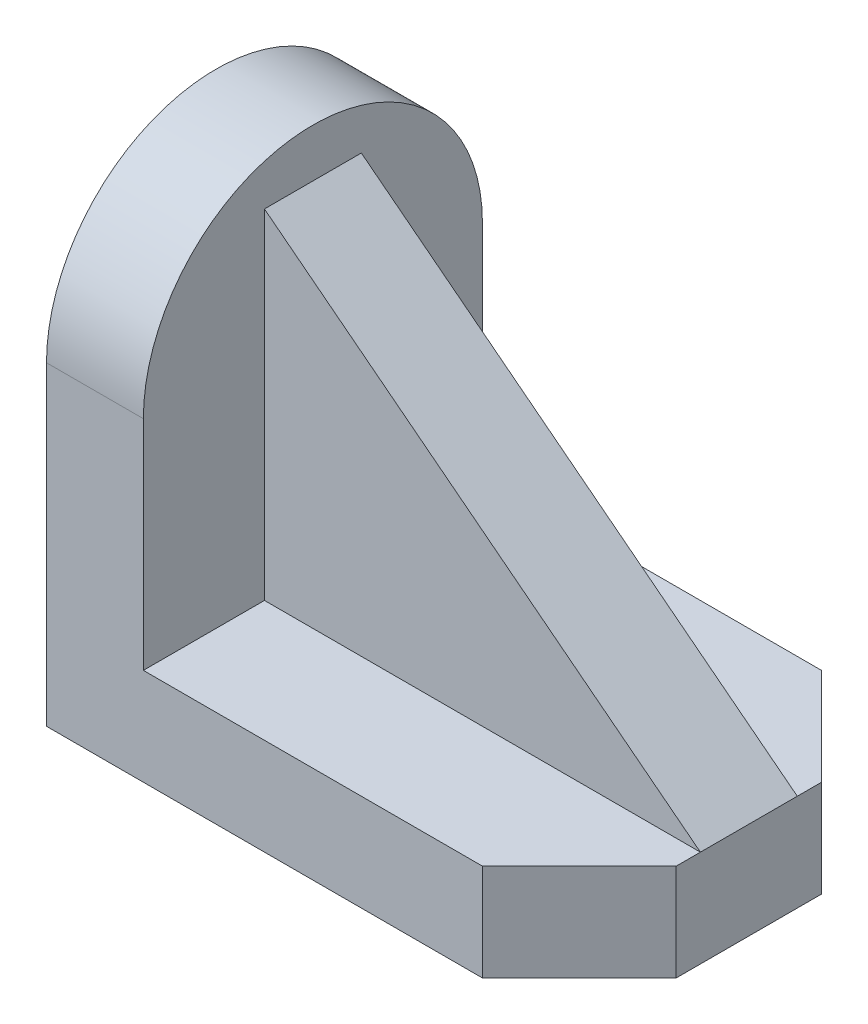
ISO-10303-21;
HEADER;
FILE_DESCRIPTION(('STEP AP214'),'2;1');
FILE_NAME('part.step','',(''),(''),'','','');
FILE_SCHEMA(('AUTOMOTIVE_DESIGN { 1 0 10303 214 1 1 1 1 }'));
ENDSEC;
DATA;
#1=APPLICATION_CONTEXT('core data for automotive mechanical design processes');
#2=APPLICATION_PROTOCOL_DEFINITION('international standard','automotive_design',2000,#1);
#3=PRODUCT_CONTEXT('',#1,'mechanical');
#4=PRODUCT('Part','Part','',(#3));
#5=PRODUCT_RELATED_PRODUCT_CATEGORY('part','',(#4));
#6=PRODUCT_DEFINITION_FORMATION('','',#4);
#7=PRODUCT_DEFINITION_CONTEXT('part definition',#1,'design');
#8=PRODUCT_DEFINITION('design','',#6,#7);
#9=PRODUCT_DEFINITION_SHAPE('','',#8);
#10=(LENGTH_UNIT() NAMED_UNIT(*) SI_UNIT(.MILLI.,.METRE.));
#11=(NAMED_UNIT(*) PLANE_ANGLE_UNIT() SI_UNIT($,.RADIAN.));
#12=(NAMED_UNIT(*) SI_UNIT($,.STERADIAN.) SOLID_ANGLE_UNIT());
#13=UNCERTAINTY_MEASURE_WITH_UNIT(LENGTH_MEASURE(1.E-05),#10,'distance_accuracy_value','');
#14=(GEOMETRIC_REPRESENTATION_CONTEXT(3) GLOBAL_UNCERTAINTY_ASSIGNED_CONTEXT((#13)) GLOBAL_UNIT_ASSIGNED_CONTEXT((#10,
#11,#12)) REPRESENTATION_CONTEXT('',''));
#15=CARTESIAN_POINT('',(0.,0.,0.));
#16=DIRECTION('',(0.,0.,1.));
#17=DIRECTION('',(1.,0.,0.));
#18=AXIS2_PLACEMENT_3D('',#15,#16,#17);
#19=CARTESIAN_POINT('',(0.,12.,0.));
#20=DIRECTION('',(0.,1.,0.));
#21=DIRECTION('',(0.,0.,1.));
#22=AXIS2_PLACEMENT_3D('',#19,#20,#21);
#23=PLANE('',#22);
#24=DIRECTION('',(0.,0.,-1.));
#25=VECTOR('',#24,1.);
#26=CARTESIAN_POINT('',(-21.,12.,0.));
#27=LINE('',#26,#25);
#28=CARTESIAN_POINT('',(-21.,12.,-6.));
#29=VERTEX_POINT('',#28);
#30=CARTESIAN_POINT('',(-21.,12.,-21.));
#31=VERTEX_POINT('',#30);
#32=EDGE_CURVE('E130',#29,#31,#27,.T.);
#33=ORIENTED_EDGE('',*,*,#32,.F.);
#34=DIRECTION('',(1.,0.,0.));
#35=VECTOR('',#34,1.);
#36=CARTESIAN_POINT('',(33.,12.,-6.));
#37=LINE('',#36,#35);
#38=CARTESIAN_POINT('',(33.,12.,-6.));
#39=VERTEX_POINT('',#38);
#40=EDGE_CURVE('E50',#29,#39,#37,.T.);
#41=ORIENTED_EDGE('',*,*,#40,.T.);
#42=DIRECTION('',(0.,0.,-1.));
#43=VECTOR('',#42,1.);
#44=CARTESIAN_POINT('',(33.,12.,-21.));
#45=LINE('',#44,#43);
#46=CARTESIAN_POINT('',(33.,12.,-8.99999999999997));
#47=VERTEX_POINT('',#46);
#48=EDGE_CURVE('E156',#39,#47,#45,.T.);
#49=ORIENTED_EDGE('',*,*,#48,.T.);
#50=DIRECTION('',(0.707106781186548,0.,0.707106781186548));
#51=VECTOR('',#50,1.);
#52=CARTESIAN_POINT('',(21.,12.,-21.));
#53=LINE('',#52,#51);
#54=CARTESIAN_POINT('',(21.,12.,-21.));
#55=VERTEX_POINT('',#54);
#56=EDGE_CURVE('E191',#47,#55,#53,.F.);
#57=ORIENTED_EDGE('',*,*,#56,.T.);
#58=DIRECTION('',(-1.,0.,0.));
#59=VECTOR('',#58,1.);
#60=CARTESIAN_POINT('',(-33.,12.,-21.));
#61=LINE('',#60,#59);
#62=EDGE_CURVE('E155',#55,#31,#61,.T.);
#63=ORIENTED_EDGE('',*,*,#62,.T.);
#64=EDGE_LOOP('',(#33,#41,#49,#57,#63));
#65=FACE_BOUND('',#64,.T.);
#66=ADVANCED_FACE('F34',(#65),#23,.T.);
#67=CARTESIAN_POINT('',(-21.,0.,0.));
#68=DIRECTION('',(1.,0.,0.));
#69=DIRECTION('',(0.,0.,-1.));
#70=AXIS2_PLACEMENT_3D('',#67,#68,#69);
#71=PLANE('',#70);
#72=DIRECTION('',(0.,0.,1.));
#73=VECTOR('',#72,1.);
#74=CARTESIAN_POINT('',(-21.,54.,-6.));
#75=LINE('',#74,#73);
#76=CARTESIAN_POINT('',(-21.,54.,-6.));
#77=VERTEX_POINT('',#76);
#78=CARTESIAN_POINT('',(-21.,54.,6.));
#79=VERTEX_POINT('',#78);
#80=EDGE_CURVE('E149',#77,#79,#75,.T.);
#81=ORIENTED_EDGE('',*,*,#80,.F.);
#82=DIRECTION('',(0.,-1.,0.));
#83=VECTOR('',#82,1.);
#84=CARTESIAN_POINT('',(-21.,12.,-6.));
#85=LINE('',#84,#83);
#86=EDGE_CURVE('E235',#77,#29,#85,.T.);
#87=ORIENTED_EDGE('',*,*,#86,.T.);
#88=ORIENTED_EDGE('',*,*,#32,.T.);
#89=DIRECTION('',(0.,1.,0.));
#90=VECTOR('',#89,1.);
#91=CARTESIAN_POINT('',(-21.,0.,-21.));
#92=LINE('',#91,#90);
#93=CARTESIAN_POINT('',(-21.,39.,-21.));
#94=VERTEX_POINT('',#93);
#95=EDGE_CURVE('E148',#31,#94,#92,.T.);
#96=ORIENTED_EDGE('',*,*,#95,.T.);
#97=CARTESIAN_POINT('',(-21.,39.,0.));
#98=DIRECTION('',(1.,0.,0.));
#99=DIRECTION('',(0.,0.,-1.));
#100=AXIS2_PLACEMENT_3D('',#97,#98,#99);
#101=CIRCLE('',#100,21.);
#102=CARTESIAN_POINT('',(-21.,39.,21.));
#103=VERTEX_POINT('',#102);
#104=EDGE_CURVE('E43',#94,#103,#101,.T.);
#105=ORIENTED_EDGE('',*,*,#104,.T.);
#106=DIRECTION('',(0.,1.,0.));
#107=VECTOR('',#106,1.);
#108=CARTESIAN_POINT('',(-21.,0.,21.));
#109=LINE('',#108,#107);
#110=CARTESIAN_POINT('',(-21.,12.,21.));
#111=VERTEX_POINT('',#110);
#112=EDGE_CURVE('E125',#111,#103,#109,.T.);
#113=ORIENTED_EDGE('',*,*,#112,.F.);
#114=CARTESIAN_POINT('',(-21.,12.,6.));
#115=VERTEX_POINT('',#114);
#116=EDGE_CURVE('E118',#111,#115,#27,.T.);
#117=ORIENTED_EDGE('',*,*,#116,.T.);
#118=DIRECTION('',(0.,-1.,0.));
#119=VECTOR('',#118,1.);
#120=CARTESIAN_POINT('',(-21.,12.,6.));
#121=LINE('',#120,#119);
#122=EDGE_CURVE('E122',#79,#115,#121,.T.);
#123=ORIENTED_EDGE('',*,*,#122,.F.);
#124=EDGE_LOOP('',(#81,#87,#88,#96,#105,#113,#117,#123));
#125=FACE_BOUND('',#124,.T.);
#126=ADVANCED_FACE('F120',(#125),#71,.T.);
#127=CARTESIAN_POINT('',(-21.,39.,0.));
#128=DIRECTION('',(-1.,0.,0.));
#129=DIRECTION('',(0.,0.,1.));
#130=AXIS2_PLACEMENT_3D('',#127,#128,#129);
#131=CYLINDRICAL_SURFACE('',#130,21.);
#132=DIRECTION('',(-1.,0.,0.));
#133=VECTOR('',#132,1.);
#134=CARTESIAN_POINT('',(-33.,39.,21.));
#135=LINE('',#134,#133);
#136=CARTESIAN_POINT('',(-33.,39.,21.));
#137=VERTEX_POINT('',#136);
#138=EDGE_CURVE('E195',#103,#137,#135,.T.);
#139=ORIENTED_EDGE('',*,*,#138,.F.);
#140=ORIENTED_EDGE('',*,*,#104,.F.);
#141=DIRECTION('',(-1.,0.,0.));
#142=VECTOR('',#141,1.);
#143=CARTESIAN_POINT('',(-33.,39.,-21.));
#144=LINE('',#143,#142);
#145=CARTESIAN_POINT('',(-33.,39.,-21.));
#146=VERTEX_POINT('',#145);
#147=EDGE_CURVE('E198',#146,#94,#144,.F.);
#148=ORIENTED_EDGE('',*,*,#147,.F.);
#149=CARTESIAN_POINT('',(-33.,39.,0.));
#150=DIRECTION('',(1.,0.,0.));
#151=DIRECTION('',(0.,0.,-1.));
#152=AXIS2_PLACEMENT_3D('',#149,#150,#151);
#153=CIRCLE('',#152,21.);
#154=EDGE_CURVE('E11',#137,#146,#153,.F.);
#155=ORIENTED_EDGE('',*,*,#154,.F.);
#156=EDGE_LOOP('',(#139,#140,#148,#155));
#157=FACE_BOUND('',#156,.T.);
#158=ADVANCED_FACE('F37',(#157),#131,.T.);
#159=CARTESIAN_POINT('',(33.,12.,-21.));
#160=DIRECTION('',(-1.,0.,0.));
#161=DIRECTION('',(0.,0.,1.));
#162=AXIS2_PLACEMENT_3D('',#159,#160,#161);
#163=PLANE('',#162);
#164=DIRECTION('',(0.,0.,-1.));
#165=VECTOR('',#164,1.);
#166=CARTESIAN_POINT('',(33.,0.,-21.));
#167=LINE('',#166,#165);
#168=CARTESIAN_POINT('',(33.,0.,8.99999999999996));
#169=VERTEX_POINT('',#168);
#170=CARTESIAN_POINT('',(33.,0.,-8.99999999999997));
#171=VERTEX_POINT('',#170);
#172=EDGE_CURVE('E129',#169,#171,#167,.T.);
#173=ORIENTED_EDGE('',*,*,#172,.T.);
#174=DIRECTION('',(0.,1.,0.));
#175=VECTOR('',#174,1.);
#176=CARTESIAN_POINT('',(33.,12.,-8.99999999999996));
#177=LINE('',#176,#175);
#178=EDGE_CURVE('E186',#171,#47,#177,.T.);
#179=ORIENTED_EDGE('',*,*,#178,.T.);
#180=ORIENTED_EDGE('',*,*,#48,.F.);
#181=DIRECTION('',(0.,0.,1.));
#182=VECTOR('',#181,1.);
#183=CARTESIAN_POINT('',(33.,12.,-6.));
#184=LINE('',#183,#182);
#185=CARTESIAN_POINT('',(33.,12.,5.99999999999999));
#186=VERTEX_POINT('',#185);
#187=EDGE_CURVE('E57',#39,#186,#184,.T.);
#188=ORIENTED_EDGE('',*,*,#187,.T.);
#189=CARTESIAN_POINT('',(33.,12.,8.99999999999996));
#190=VERTEX_POINT('',#189);
#191=EDGE_CURVE('E135',#190,#186,#45,.T.);
#192=ORIENTED_EDGE('',*,*,#191,.F.);
#193=DIRECTION('',(0.,-1.,0.));
#194=VECTOR('',#193,1.);
#195=CARTESIAN_POINT('',(33.,12.,8.99999999999996));
#196=LINE('',#195,#194);
#197=EDGE_CURVE('E183',#190,#169,#196,.T.);
#198=ORIENTED_EDGE('',*,*,#197,.T.);
#199=EDGE_LOOP('',(#173,#179,#180,#188,#192,#198));
#200=FACE_BOUND('',#199,.T.);
#201=ADVANCED_FACE('F213',(#200),#163,.F.);
#202=CARTESIAN_POINT('',(-33.,12.,-21.));
#203=DIRECTION('',(0.,0.,1.));
#204=DIRECTION('',(1.,0.,0.));
#205=AXIS2_PLACEMENT_3D('',#202,#203,#204);
#206=PLANE('',#205);
#207=DIRECTION('',(0.,-1.,0.));
#208=VECTOR('',#207,1.);
#209=CARTESIAN_POINT('',(-33.,12.,-21.));
#210=LINE('',#209,#208);
#211=CARTESIAN_POINT('',(-33.,0.,-21.));
#212=VERTEX_POINT('',#211);
#213=EDGE_CURVE('E174',#146,#212,#210,.T.);
#214=ORIENTED_EDGE('',*,*,#213,.F.);
#215=ORIENTED_EDGE('',*,*,#147,.T.);
#216=ORIENTED_EDGE('',*,*,#95,.F.);
#217=ORIENTED_EDGE('',*,*,#62,.F.);
#218=DIRECTION('',(0.,-1.,0.));
#219=VECTOR('',#218,1.);
#220=CARTESIAN_POINT('',(21.,12.,-21.));
#221=LINE('',#220,#219);
#222=CARTESIAN_POINT('',(21.,0.,-21.));
#223=VERTEX_POINT('',#222);
#224=EDGE_CURVE('E176',#55,#223,#221,.T.);
#225=ORIENTED_EDGE('',*,*,#224,.T.);
#226=DIRECTION('',(-1.,0.,0.));
#227=VECTOR('',#226,1.);
#228=CARTESIAN_POINT('',(-33.,0.,-21.));
#229=LINE('',#228,#227);
#230=EDGE_CURVE('E164',#223,#212,#229,.T.);
#231=ORIENTED_EDGE('',*,*,#230,.T.);
#232=EDGE_LOOP('',(#214,#215,#216,#217,#225,#231));
#233=FACE_BOUND('',#232,.T.);
#234=ADVANCED_FACE('F227',(#233),#206,.F.);
#235=CARTESIAN_POINT('',(-33.,12.,-21.));
#236=DIRECTION('',(1.,0.,0.));
#237=DIRECTION('',(0.,0.,-1.));
#238=AXIS2_PLACEMENT_3D('',#235,#236,#237);
#239=PLANE('',#238);
#240=DIRECTION('',(0.,-1.,0.));
#241=VECTOR('',#240,1.);
#242=CARTESIAN_POINT('',(-33.,12.,21.));
#243=LINE('',#242,#241);
#244=CARTESIAN_POINT('',(-33.,0.,21.));
#245=VERTEX_POINT('',#244);
#246=EDGE_CURVE('E161',#137,#245,#243,.T.);
#247=ORIENTED_EDGE('',*,*,#246,.F.);
#248=ORIENTED_EDGE('',*,*,#154,.T.);
#249=ORIENTED_EDGE('',*,*,#213,.T.);
#250=DIRECTION('',(0.,0.,1.));
#251=VECTOR('',#250,1.);
#252=CARTESIAN_POINT('',(-33.,0.,-21.));
#253=LINE('',#252,#251);
#254=EDGE_CURVE('E167',#212,#245,#253,.T.);
#255=ORIENTED_EDGE('',*,*,#254,.T.);
#256=EDGE_LOOP('',(#247,#248,#249,#255));
#257=FACE_BOUND('',#256,.T.);
#258=ADVANCED_FACE('F258',(#257),#239,.F.);
#259=CARTESIAN_POINT('',(-33.,12.,21.));
#260=DIRECTION('',(0.,0.,-1.));
#261=DIRECTION('',(-1.,0.,0.));
#262=AXIS2_PLACEMENT_3D('',#259,#260,#261);
#263=PLANE('',#262);
#264=ORIENTED_EDGE('',*,*,#112,.T.);
#265=ORIENTED_EDGE('',*,*,#138,.T.);
#266=ORIENTED_EDGE('',*,*,#246,.T.);
#267=DIRECTION('',(1.,0.,0.));
#268=VECTOR('',#267,1.);
#269=CARTESIAN_POINT('',(-33.,0.,21.));
#270=LINE('',#269,#268);
#271=CARTESIAN_POINT('',(21.,0.,21.));
#272=VERTEX_POINT('',#271);
#273=EDGE_CURVE('E170',#245,#272,#270,.T.);
#274=ORIENTED_EDGE('',*,*,#273,.T.);
#275=DIRECTION('',(0.,1.,0.));
#276=VECTOR('',#275,1.);
#277=CARTESIAN_POINT('',(21.,12.,21.));
#278=LINE('',#277,#276);
#279=CARTESIAN_POINT('',(21.,12.,21.));
#280=VERTEX_POINT('',#279);
#281=EDGE_CURVE('E193',#272,#280,#278,.T.);
#282=ORIENTED_EDGE('',*,*,#281,.T.);
#283=DIRECTION('',(1.,0.,0.));
#284=VECTOR('',#283,1.);
#285=CARTESIAN_POINT('',(-33.,12.,21.));
#286=LINE('',#285,#284);
#287=EDGE_CURVE('E159',#111,#280,#286,.T.);
#288=ORIENTED_EDGE('',*,*,#287,.F.);
#289=EDGE_LOOP('',(#264,#265,#266,#274,#282,#288));
#290=FACE_BOUND('',#289,.T.);
#291=ADVANCED_FACE('F206',(#290),#263,.F.);
#292=DIRECTION('',(1.,0.,0.));
#293=VECTOR('',#292,1.);
#294=CARTESIAN_POINT('',(33.,12.,6.));
#295=LINE('',#294,#293);
#296=EDGE_CURVE('E133',#115,#186,#295,.T.);
#297=ORIENTED_EDGE('',*,*,#296,.F.);
#298=ORIENTED_EDGE('',*,*,#116,.F.);
#299=ORIENTED_EDGE('',*,*,#287,.T.);
#300=DIRECTION('',(-0.707106781186548,0.,0.707106781186548));
#301=VECTOR('',#300,1.);
#302=CARTESIAN_POINT('',(21.,12.,21.));
#303=LINE('',#302,#301);
#304=EDGE_CURVE('E189',#280,#190,#303,.F.);
#305=ORIENTED_EDGE('',*,*,#304,.T.);
#306=ORIENTED_EDGE('',*,*,#191,.T.);
#307=EDGE_LOOP('',(#297,#298,#299,#305,#306));
#308=FACE_BOUND('',#307,.T.);
#309=ADVANCED_FACE('F134',(#308),#23,.T.);
#310=CARTESIAN_POINT('',(0.,0.,0.));
#311=DIRECTION('',(0.,1.,0.));
#312=DIRECTION('',(0.,0.,1.));
#313=AXIS2_PLACEMENT_3D('',#310,#311,#312);
#314=PLANE('',#313);
#315=ORIENTED_EDGE('',*,*,#230,.F.);
#316=DIRECTION('',(-0.707106781186548,0.,-0.707106781186548));
#317=VECTOR('',#316,1.);
#318=CARTESIAN_POINT('',(21.,0.,-21.));
#319=LINE('',#318,#317);
#320=EDGE_CURVE('E181',#223,#171,#319,.F.);
#321=ORIENTED_EDGE('',*,*,#320,.T.);
#322=ORIENTED_EDGE('',*,*,#172,.F.);
#323=DIRECTION('',(0.707106781186548,0.,-0.707106781186548));
#324=VECTOR('',#323,1.);
#325=CARTESIAN_POINT('',(33.,0.,8.99999999999996));
#326=LINE('',#325,#324);
#327=EDGE_CURVE('E179',#169,#272,#326,.F.);
#328=ORIENTED_EDGE('',*,*,#327,.T.);
#329=ORIENTED_EDGE('',*,*,#273,.F.);
#330=ORIENTED_EDGE('',*,*,#254,.F.);
#331=EDGE_LOOP('',(#315,#321,#322,#328,#329,#330));
#332=FACE_BOUND('',#331,.T.);
#333=ADVANCED_FACE('F217',(#332),#314,.F.);
#334=CARTESIAN_POINT('',(21.,12.,-21.));
#335=DIRECTION('',(-0.707106781186547,0.,0.707106781186547));
#336=DIRECTION('',(0.,-1.,0.));
#337=AXIS2_PLACEMENT_3D('',#334,#335,#336);
#338=PLANE('',#337);
#339=ORIENTED_EDGE('',*,*,#56,.F.);
#340=ORIENTED_EDGE('',*,*,#178,.F.);
#341=ORIENTED_EDGE('',*,*,#320,.F.);
#342=ORIENTED_EDGE('',*,*,#224,.F.);
#343=EDGE_LOOP('',(#339,#340,#341,#342));
#344=FACE_BOUND('',#343,.T.);
#345=ADVANCED_FACE('F223',(#344),#338,.F.);
#346=CARTESIAN_POINT('',(33.,12.,8.99999999999996));
#347=DIRECTION('',(-0.707106781186547,0.,-0.707106781186547));
#348=DIRECTION('',(0.,-1.,0.));
#349=AXIS2_PLACEMENT_3D('',#346,#347,#348);
#350=PLANE('',#349);
#351=ORIENTED_EDGE('',*,*,#304,.F.);
#352=ORIENTED_EDGE('',*,*,#281,.F.);
#353=ORIENTED_EDGE('',*,*,#327,.F.);
#354=ORIENTED_EDGE('',*,*,#197,.F.);
#355=EDGE_LOOP('',(#351,#352,#353,#354));
#356=FACE_BOUND('',#355,.T.);
#357=ADVANCED_FACE('F211',(#356),#350,.F.);
#358=CARTESIAN_POINT('',(-21.,54.,-6.));
#359=DIRECTION('',(0.613940613514921,0.789352217376326,0.));
#360=DIRECTION('',(-0.789352217376326,0.613940613514921,0.));
#361=AXIS2_PLACEMENT_3D('',#358,#359,#360);
#362=PLANE('',#361);
#363=DIRECTION('',(-0.789352217376326,0.61394061351492,0.));
#364=VECTOR('',#363,1.);
#365=CARTESIAN_POINT('',(-21.,54.,6.));
#366=LINE('',#365,#364);
#367=EDGE_CURVE('E142',#186,#79,#366,.T.);
#368=ORIENTED_EDGE('',*,*,#367,.F.);
#369=ORIENTED_EDGE('',*,*,#187,.F.);
#370=DIRECTION('',(-0.789352217376326,0.61394061351492,0.));
#371=VECTOR('',#370,1.);
#372=CARTESIAN_POINT('',(-21.,54.,-6.));
#373=LINE('',#372,#371);
#374=EDGE_CURVE('E139',#39,#77,#373,.T.);
#375=ORIENTED_EDGE('',*,*,#374,.T.);
#376=ORIENTED_EDGE('',*,*,#80,.T.);
#377=EDGE_LOOP('',(#368,#369,#375,#376));
#378=FACE_BOUND('',#377,.T.);
#379=ADVANCED_FACE('F231',(#378),#362,.T.);
#380=CARTESIAN_POINT('',(0.,0.,-6.));
#381=DIRECTION('',(0.,0.,1.));
#382=DIRECTION('',(1.,0.,0.));
#383=AXIS2_PLACEMENT_3D('',#380,#381,#382);
#384=PLANE('',#383);
#385=ORIENTED_EDGE('',*,*,#374,.F.);
#386=ORIENTED_EDGE('',*,*,#40,.F.);
#387=ORIENTED_EDGE('',*,*,#86,.F.);
#388=EDGE_LOOP('',(#385,#386,#387));
#389=FACE_BOUND('',#388,.T.);
#390=ADVANCED_FACE('F234',(#389),#384,.F.);
#391=CARTESIAN_POINT('',(0.,0.,6.));
#392=DIRECTION('',(0.,0.,1.));
#393=DIRECTION('',(1.,0.,0.));
#394=AXIS2_PLACEMENT_3D('',#391,#392,#393);
#395=PLANE('',#394);
#396=ORIENTED_EDGE('',*,*,#367,.T.);
#397=ORIENTED_EDGE('',*,*,#122,.T.);
#398=ORIENTED_EDGE('',*,*,#296,.T.);
#399=EDGE_LOOP('',(#396,#397,#398));
#400=FACE_BOUND('',#399,.T.);
#401=ADVANCED_FACE('F141',(#400),#395,.T.);
#402=CLOSED_SHELL('',(#66,#126,#158,#201,#234,#258,#291,#309,#333,#345,#357,#379,#390,#401));
#403=MANIFOLD_SOLID_BREP('B2',#402);
#404=ADVANCED_BREP_SHAPE_REPRESENTATION('',(#18,#403),#14);
#405=SHAPE_DEFINITION_REPRESENTATION(#9,#404);
ENDSEC;
END-ISO-10303-21;
